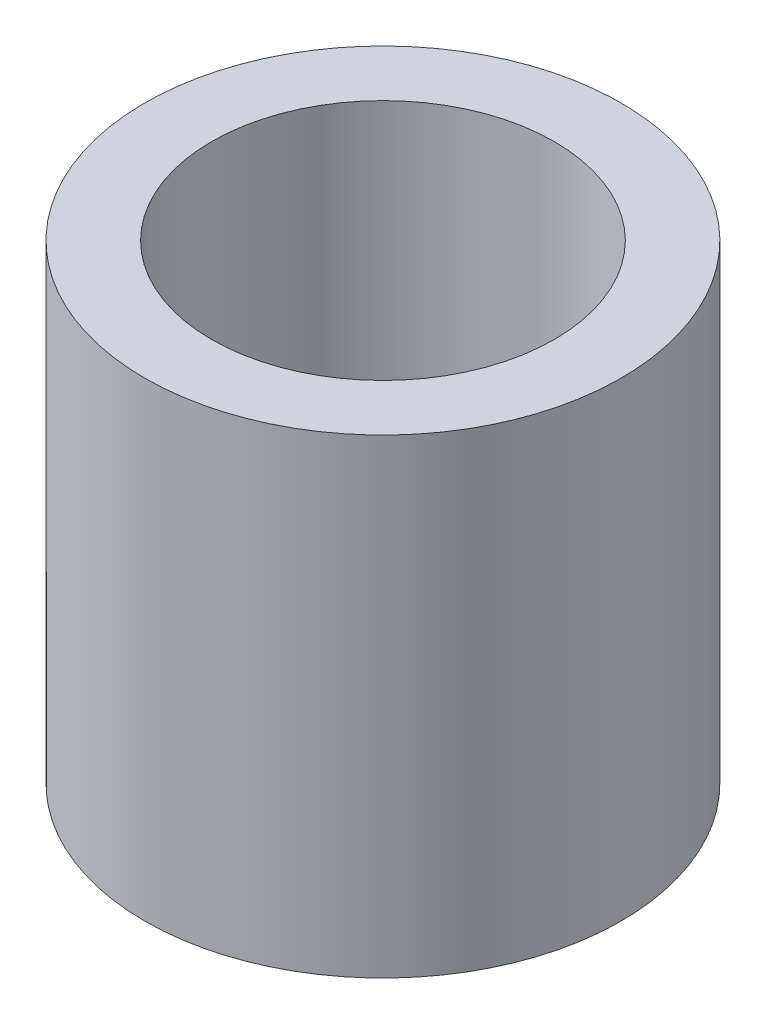
ISO-10303-21;
HEADER;
FILE_DESCRIPTION(('STEP AP214'),'2;1');
FILE_NAME('part.step','',(''),(''),'','','');
FILE_SCHEMA(('AUTOMOTIVE_DESIGN { 1 0 10303 214 1 1 1 1 }'));
ENDSEC;
DATA;
#1=APPLICATION_CONTEXT('core data for automotive mechanical design processes');
#2=APPLICATION_PROTOCOL_DEFINITION('international standard','automotive_design',2000,#1);
#3=PRODUCT_CONTEXT('',#1,'mechanical');
#4=PRODUCT('Part','Part','',(#3));
#5=PRODUCT_RELATED_PRODUCT_CATEGORY('part','',(#4));
#6=PRODUCT_DEFINITION_FORMATION('','',#4);
#7=PRODUCT_DEFINITION_CONTEXT('part definition',#1,'design');
#8=PRODUCT_DEFINITION('design','',#6,#7);
#9=PRODUCT_DEFINITION_SHAPE('','',#8);
#10=(LENGTH_UNIT() NAMED_UNIT(*) SI_UNIT(.MILLI.,.METRE.));
#11=(NAMED_UNIT(*) PLANE_ANGLE_UNIT() SI_UNIT($,.RADIAN.));
#12=(NAMED_UNIT(*) SI_UNIT($,.STERADIAN.) SOLID_ANGLE_UNIT());
#13=UNCERTAINTY_MEASURE_WITH_UNIT(LENGTH_MEASURE(1.E-05),#10,'distance_accuracy_value','');
#14=(GEOMETRIC_REPRESENTATION_CONTEXT(3) GLOBAL_UNCERTAINTY_ASSIGNED_CONTEXT((#13)) GLOBAL_UNIT_ASSIGNED_CONTEXT((#10,
#11,#12)) REPRESENTATION_CONTEXT('',''));
#15=CARTESIAN_POINT('',(0.,0.,0.));
#16=DIRECTION('',(0.,0.,1.));
#17=DIRECTION('',(1.,0.,0.));
#18=AXIS2_PLACEMENT_3D('',#15,#16,#17);
#19=CARTESIAN_POINT('',(0.,44.4062393891538,0.));
#20=DIRECTION('',(0.,-1.,0.));
#21=DIRECTION('',(0.,0.,-1.));
#22=AXIS2_PLACEMENT_3D('',#19,#20,#21);
#23=CYLINDRICAL_SURFACE('',#22,22.5);
#24=CARTESIAN_POINT('',(0.,44.4062393891538,0.));
#25=DIRECTION('',(0.,1.,0.));
#26=DIRECTION('',(0.,0.,1.));
#27=AXIS2_PLACEMENT_3D('',#24,#25,#26);
#28=CIRCLE('',#27,22.5);
#29=CARTESIAN_POINT('',(0.,44.4062393891538,22.5));
#30=VERTEX_POINT('',#29);
#31=EDGE_CURVE('E10',#30,#30,#28,.T.);
#32=ORIENTED_EDGE('',*,*,#31,.F.);
#33=EDGE_LOOP('',(#32));
#34=FACE_BOUND('',#33,.T.);
#35=CARTESIAN_POINT('',(0.,0.,0.));
#36=DIRECTION('',(0.,1.,0.));
#37=DIRECTION('',(0.,0.,1.));
#38=AXIS2_PLACEMENT_3D('',#35,#36,#37);
#39=CIRCLE('',#38,22.5);
#40=CARTESIAN_POINT('',(0.,0.,22.5));
#41=VERTEX_POINT('',#40);
#42=EDGE_CURVE('E37',#41,#41,#39,.T.);
#43=ORIENTED_EDGE('',*,*,#42,.T.);
#44=EDGE_LOOP('',(#43));
#45=FACE_BOUND('',#44,.T.);
#46=ADVANCED_FACE('F40',(#34,#45),#23,.T.);
#47=CARTESIAN_POINT('',(0.,44.4062393891538,0.));
#48=DIRECTION('',(0.,1.,0.));
#49=DIRECTION('',(0.,0.,1.));
#50=AXIS2_PLACEMENT_3D('',#47,#48,#49);
#51=PLANE('',#50);
#52=CARTESIAN_POINT('',(0.,44.4062393891538,0.));
#53=DIRECTION('',(0.,1.,0.));
#54=DIRECTION('',(0.,0.,1.));
#55=AXIS2_PLACEMENT_3D('',#52,#53,#54);
#56=CIRCLE('',#55,16.1849097084638);
#57=CARTESIAN_POINT('',(0.,44.4062393891538,16.1849097084638));
#58=VERTEX_POINT('',#57);
#59=EDGE_CURVE('E50',#58,#58,#56,.T.);
#60=ORIENTED_EDGE('',*,*,#59,.F.);
#61=EDGE_LOOP('',(#60));
#62=FACE_BOUND('',#61,.T.);
#63=ORIENTED_EDGE('',*,*,#31,.T.);
#64=EDGE_LOOP('',(#63));
#65=FACE_BOUND('',#64,.T.);
#66=ADVANCED_FACE('F59',(#62,#65),#51,.T.);
#67=CARTESIAN_POINT('',(0.,0.,0.));
#68=DIRECTION('',(0.,1.,0.));
#69=DIRECTION('',(0.,0.,1.));
#70=AXIS2_PLACEMENT_3D('',#67,#68,#69);
#71=PLANE('',#70);
#72=CARTESIAN_POINT('',(0.,0.,0.));
#73=DIRECTION('',(0.,1.,0.));
#74=DIRECTION('',(0.,0.,1.));
#75=AXIS2_PLACEMENT_3D('',#72,#73,#74);
#76=CIRCLE('',#75,16.1849097084638);
#77=CARTESIAN_POINT('',(0.,0.,16.1849097084638));
#78=VERTEX_POINT('',#77);
#79=EDGE_CURVE('E47',#78,#78,#76,.T.);
#80=ORIENTED_EDGE('',*,*,#79,.T.);
#81=EDGE_LOOP('',(#80));
#82=FACE_BOUND('',#81,.T.);
#83=ORIENTED_EDGE('',*,*,#42,.F.);
#84=EDGE_LOOP('',(#83));
#85=FACE_BOUND('',#84,.T.);
#86=ADVANCED_FACE('F58',(#82,#85),#71,.F.);
#87=CARTESIAN_POINT('',(0.,44.4062393891538,0.));
#88=DIRECTION('',(0.,-1.,0.));
#89=DIRECTION('',(0.,0.,-1.));
#90=AXIS2_PLACEMENT_3D('',#87,#88,#89);
#91=CYLINDRICAL_SURFACE('',#90,16.1849097084638);
#92=ORIENTED_EDGE('',*,*,#59,.T.);
#93=EDGE_LOOP('',(#92));
#94=FACE_BOUND('',#93,.T.);
#95=ORIENTED_EDGE('',*,*,#79,.F.);
#96=EDGE_LOOP('',(#95));
#97=FACE_BOUND('',#96,.T.);
#98=ADVANCED_FACE('F54',(#94,#97),#91,.F.);
#99=CLOSED_SHELL('',(#46,#66,#86,#98));
#100=MANIFOLD_SOLID_BREP('B2',#99);
#101=ADVANCED_BREP_SHAPE_REPRESENTATION('',(#18,#100),#14);
#102=SHAPE_DEFINITION_REPRESENTATION(#9,#101);
ENDSEC;
END-ISO-10303-21;
